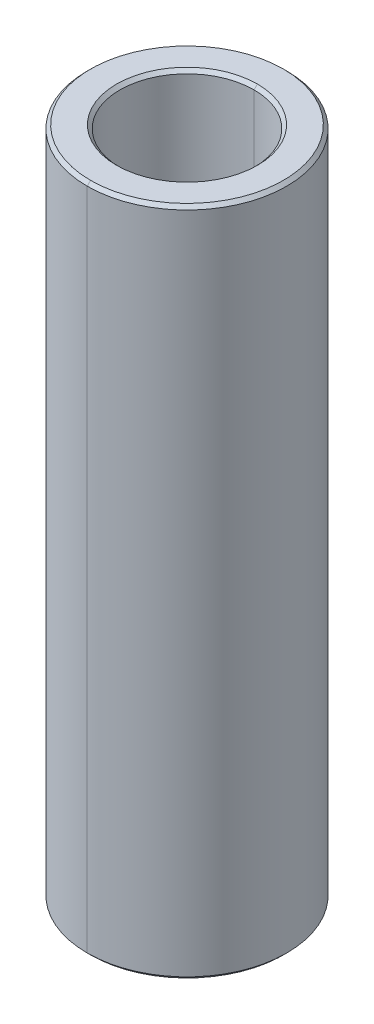
ISO-10303-21;
HEADER;
FILE_DESCRIPTION(('STEP AP214'),'2;1');
FILE_NAME('part.step','',(''),(''),'','','');
FILE_SCHEMA(('AUTOMOTIVE_DESIGN { 1 0 10303 214 1 1 1 1 }'));
ENDSEC;
DATA;
#1=APPLICATION_CONTEXT('core data for automotive mechanical design processes');
#2=APPLICATION_PROTOCOL_DEFINITION('international standard','automotive_design',2000,#1);
#3=PRODUCT_CONTEXT('',#1,'mechanical');
#4=PRODUCT('Part','Part','',(#3));
#5=PRODUCT_RELATED_PRODUCT_CATEGORY('part','',(#4));
#6=PRODUCT_DEFINITION_FORMATION('','',#4);
#7=PRODUCT_DEFINITION_CONTEXT('part definition',#1,'design');
#8=PRODUCT_DEFINITION('design','',#6,#7);
#9=PRODUCT_DEFINITION_SHAPE('','',#8);
#10=(LENGTH_UNIT() NAMED_UNIT(*) SI_UNIT(.MILLI.,.METRE.));
#11=(NAMED_UNIT(*) PLANE_ANGLE_UNIT() SI_UNIT($,.RADIAN.));
#12=(NAMED_UNIT(*) SI_UNIT($,.STERADIAN.) SOLID_ANGLE_UNIT());
#13=UNCERTAINTY_MEASURE_WITH_UNIT(LENGTH_MEASURE(1.E-05),#10,'distance_accuracy_value','');
#14=(GEOMETRIC_REPRESENTATION_CONTEXT(3) GLOBAL_UNCERTAINTY_ASSIGNED_CONTEXT((#13)) GLOBAL_UNIT_ASSIGNED_CONTEXT((#10,
#11,#12)) REPRESENTATION_CONTEXT('',''));
#15=CARTESIAN_POINT('',(0.,0.,0.));
#16=DIRECTION('',(0.,0.,1.));
#17=DIRECTION('',(1.,0.,0.));
#18=AXIS2_PLACEMENT_3D('',#15,#16,#17);
#19=CARTESIAN_POINT('',(0.,9.9,0.));
#20=DIRECTION('',(0.,1.,0.));
#21=DIRECTION('',(0.,0.,1.));
#22=AXIS2_PLACEMENT_3D('',#19,#20,#21);
#23=CONICAL_SURFACE('',#22,2.,0.785398163397448);
#24=DIRECTION('',(0.,0.707106781186548,-0.707106781186548));
#25=VECTOR('',#24,1.);
#26=CARTESIAN_POINT('',(0.,9.9,-2.));
#27=LINE('',#26,#25);
#28=CARTESIAN_POINT('',(0.,9.9,-2.));
#29=VERTEX_POINT('',#28);
#30=CARTESIAN_POINT('',(0.,10.,-2.1));
#31=VERTEX_POINT('',#30);
#32=EDGE_CURVE('E206',#29,#31,#27,.T.);
#33=ORIENTED_EDGE('',*,*,#32,.F.);
#34=CARTESIAN_POINT('',(0.,9.9,0.));
#35=DIRECTION('',(0.,1.,0.));
#36=DIRECTION('',(0.,0.,1.));
#37=AXIS2_PLACEMENT_3D('',#34,#35,#36);
#38=CIRCLE('',#37,2.);
#39=CARTESIAN_POINT('',(0.,9.9,2.));
#40=VERTEX_POINT('',#39);
#41=EDGE_CURVE('E27',#40,#29,#38,.T.);
#42=ORIENTED_EDGE('',*,*,#41,.F.);
#43=DIRECTION('',(0.,0.707106781186548,0.707106781186548));
#44=VECTOR('',#43,1.);
#45=CARTESIAN_POINT('',(0.,9.9,2.));
#46=LINE('',#45,#44);
#47=CARTESIAN_POINT('',(0.,10.,2.1));
#48=VERTEX_POINT('',#47);
#49=EDGE_CURVE('E146',#40,#48,#46,.T.);
#50=ORIENTED_EDGE('',*,*,#49,.T.);
#51=CARTESIAN_POINT('',(0.,10.,0.));
#52=DIRECTION('',(0.,-1.,0.));
#53=DIRECTION('',(0.,0.,1.));
#54=AXIS2_PLACEMENT_3D('',#51,#52,#53);
#55=CIRCLE('',#54,2.1);
#56=EDGE_CURVE('E121',#31,#48,#55,.T.);
#57=ORIENTED_EDGE('',*,*,#56,.F.);
#58=EDGE_LOOP('',(#33,#42,#50,#57));
#59=FACE_BOUND('',#58,.T.);
#60=ADVANCED_FACE('F16',(#59),#23,.F.);
#61=CARTESIAN_POINT('',(0.,-10.,0.));
#62=DIRECTION('',(0.,-1.,0.));
#63=DIRECTION('',(0.,0.,-1.));
#64=AXIS2_PLACEMENT_3D('',#61,#62,#63);
#65=CONICAL_SURFACE('',#64,2.1,0.785398163397448);
#66=DIRECTION('',(0.,-0.707106781186548,0.707106781186548));
#67=VECTOR('',#66,1.);
#68=CARTESIAN_POINT('',(0.,-10.,2.1));
#69=LINE('',#68,#67);
#70=CARTESIAN_POINT('',(0.,-9.9,2.));
#71=VERTEX_POINT('',#70);
#72=CARTESIAN_POINT('',(0.,-10.,2.1));
#73=VERTEX_POINT('',#72);
#74=EDGE_CURVE('E130',#71,#73,#69,.T.);
#75=ORIENTED_EDGE('',*,*,#74,.F.);
#76=CARTESIAN_POINT('',(0.,-9.9,0.));
#77=DIRECTION('',(0.,-1.,0.));
#78=DIRECTION('',(0.,0.,1.));
#79=AXIS2_PLACEMENT_3D('',#76,#77,#78);
#80=CIRCLE('',#79,2.);
#81=CARTESIAN_POINT('',(0.,-9.9,-2.));
#82=VERTEX_POINT('',#81);
#83=EDGE_CURVE('E10',#82,#71,#80,.T.);
#84=ORIENTED_EDGE('',*,*,#83,.F.);
#85=DIRECTION('',(0.,-0.707106781186548,-0.707106781186548));
#86=VECTOR('',#85,1.);
#87=CARTESIAN_POINT('',(0.,-10.,-2.1));
#88=LINE('',#87,#86);
#89=CARTESIAN_POINT('',(0.,-10.,-2.1));
#90=VERTEX_POINT('',#89);
#91=EDGE_CURVE('E138',#82,#90,#88,.T.);
#92=ORIENTED_EDGE('',*,*,#91,.T.);
#93=CARTESIAN_POINT('',(0.,-10.,0.));
#94=DIRECTION('',(0.,1.,0.));
#95=DIRECTION('',(0.,0.,1.));
#96=AXIS2_PLACEMENT_3D('',#93,#94,#95);
#97=CIRCLE('',#96,2.1);
#98=EDGE_CURVE('E79',#73,#90,#97,.T.);
#99=ORIENTED_EDGE('',*,*,#98,.F.);
#100=EDGE_LOOP('',(#75,#84,#92,#99));
#101=FACE_BOUND('',#100,.T.);
#102=ADVANCED_FACE('F261',(#101),#65,.F.);
#103=CARTESIAN_POINT('',(0.,10.,0.));
#104=DIRECTION('',(0.,-1.,0.));
#105=DIRECTION('',(0.,0.,-1.));
#106=AXIS2_PLACEMENT_3D('',#103,#104,#105);
#107=CONICAL_SURFACE('',#106,2.875,0.78539816339744);
#108=DIRECTION('',(0.,-0.707106781186554,0.707106781186542));
#109=VECTOR('',#108,1.);
#110=CARTESIAN_POINT('',(0.,10.,2.875));
#111=LINE('',#110,#109);
#112=CARTESIAN_POINT('',(0.,10.,2.875));
#113=VERTEX_POINT('',#112);
#114=CARTESIAN_POINT('',(0.,9.9,2.975));
#115=VERTEX_POINT('',#114);
#116=EDGE_CURVE('E104',#113,#115,#111,.T.);
#117=ORIENTED_EDGE('',*,*,#116,.F.);
#118=CARTESIAN_POINT('',(0.,10.,0.));
#119=DIRECTION('',(0.,1.,0.));
#120=DIRECTION('',(0.,0.,1.));
#121=AXIS2_PLACEMENT_3D('',#118,#119,#120);
#122=CIRCLE('',#121,2.875);
#123=CARTESIAN_POINT('',(0.,10.,-2.875));
#124=VERTEX_POINT('',#123);
#125=EDGE_CURVE('E90',#124,#113,#122,.T.);
#126=ORIENTED_EDGE('',*,*,#125,.F.);
#127=DIRECTION('',(0.,-0.707106781186554,-0.707106781186542));
#128=VECTOR('',#127,1.);
#129=CARTESIAN_POINT('',(0.,10.,-2.875));
#130=LINE('',#129,#128);
#131=CARTESIAN_POINT('',(0.,9.9,-2.975));
#132=VERTEX_POINT('',#131);
#133=EDGE_CURVE('E94',#124,#132,#130,.T.);
#134=ORIENTED_EDGE('',*,*,#133,.T.);
#135=CARTESIAN_POINT('',(0.,9.9,0.));
#136=DIRECTION('',(0.,-1.,0.));
#137=DIRECTION('',(0.,0.,1.));
#138=AXIS2_PLACEMENT_3D('',#135,#136,#137);
#139=CIRCLE('',#138,2.975);
#140=EDGE_CURVE('E68',#115,#132,#139,.T.);
#141=ORIENTED_EDGE('',*,*,#140,.F.);
#142=EDGE_LOOP('',(#117,#126,#134,#141));
#143=FACE_BOUND('',#142,.T.);
#144=ADVANCED_FACE('F95',(#143),#107,.T.);
#145=CARTESIAN_POINT('',(0.,-9.9,0.));
#146=DIRECTION('',(0.,1.,0.));
#147=DIRECTION('',(0.,0.,1.));
#148=AXIS2_PLACEMENT_3D('',#145,#146,#147);
#149=CONICAL_SURFACE('',#148,2.975,0.78539816339744);
#150=DIRECTION('',(0.,0.707106781186554,-0.707106781186542));
#151=VECTOR('',#150,1.);
#152=CARTESIAN_POINT('',(0.,-9.9,-2.975));
#153=LINE('',#152,#151);
#154=CARTESIAN_POINT('',(0.,-10.,-2.875));
#155=VERTEX_POINT('',#154);
#156=CARTESIAN_POINT('',(0.,-9.9,-2.975));
#157=VERTEX_POINT('',#156);
#158=EDGE_CURVE('E129',#155,#157,#153,.T.);
#159=ORIENTED_EDGE('',*,*,#158,.F.);
#160=CARTESIAN_POINT('',(0.,-10.,0.));
#161=DIRECTION('',(0.,-1.,0.));
#162=DIRECTION('',(0.,0.,1.));
#163=AXIS2_PLACEMENT_3D('',#160,#161,#162);
#164=CIRCLE('',#163,2.875);
#165=CARTESIAN_POINT('',(0.,-10.,2.875));
#166=VERTEX_POINT('',#165);
#167=EDGE_CURVE('E62',#166,#155,#164,.T.);
#168=ORIENTED_EDGE('',*,*,#167,.F.);
#169=DIRECTION('',(0.,0.707106781186554,0.707106781186542));
#170=VECTOR('',#169,1.);
#171=CARTESIAN_POINT('',(0.,-9.9,2.975));
#172=LINE('',#171,#170);
#173=CARTESIAN_POINT('',(0.,-9.9,2.975));
#174=VERTEX_POINT('',#173);
#175=EDGE_CURVE('E113',#166,#174,#172,.T.);
#176=ORIENTED_EDGE('',*,*,#175,.T.);
#177=CARTESIAN_POINT('',(0.,-9.9,0.));
#178=DIRECTION('',(0.,1.,0.));
#179=DIRECTION('',(0.,0.,1.));
#180=AXIS2_PLACEMENT_3D('',#177,#178,#179);
#181=CIRCLE('',#180,2.975);
#182=EDGE_CURVE('E42',#157,#174,#181,.T.);
#183=ORIENTED_EDGE('',*,*,#182,.F.);
#184=EDGE_LOOP('',(#159,#168,#176,#183));
#185=FACE_BOUND('',#184,.T.);
#186=ADVANCED_FACE('F250',(#185),#149,.T.);
#187=CARTESIAN_POINT('',(0.,10.,0.));
#188=DIRECTION('',(0.,-1.,0.));
#189=DIRECTION('',(0.,0.,-1.));
#190=AXIS2_PLACEMENT_3D('',#187,#188,#189);
#191=CYLINDRICAL_SURFACE('',#190,2.);
#192=DIRECTION('',(0.,-1.,0.));
#193=VECTOR('',#192,1.);
#194=CARTESIAN_POINT('',(0.,10.,2.));
#195=LINE('',#194,#193);
#196=EDGE_CURVE('E117',#40,#71,#195,.T.);
#197=ORIENTED_EDGE('',*,*,#196,.F.);
#198=ORIENTED_EDGE('',*,*,#41,.T.);
#199=DIRECTION('',(0.,-1.,0.));
#200=VECTOR('',#199,1.);
#201=CARTESIAN_POINT('',(0.,10.,-2.));
#202=LINE('',#201,#200);
#203=EDGE_CURVE('E20',#29,#82,#202,.T.);
#204=ORIENTED_EDGE('',*,*,#203,.T.);
#205=ORIENTED_EDGE('',*,*,#83,.T.);
#206=EDGE_LOOP('',(#197,#198,#204,#205));
#207=FACE_BOUND('',#206,.T.);
#208=ADVANCED_FACE('F258',(#207),#191,.F.);
#209=CARTESIAN_POINT('',(0.,10.,0.));
#210=DIRECTION('',(0.,-1.,0.));
#211=DIRECTION('',(0.,0.,-1.));
#212=AXIS2_PLACEMENT_3D('',#209,#210,#211);
#213=CYLINDRICAL_SURFACE('',#212,2.975);
#214=DIRECTION('',(0.,-1.,0.));
#215=VECTOR('',#214,1.);
#216=CARTESIAN_POINT('',(0.,10.,2.975));
#217=LINE('',#216,#215);
#218=EDGE_CURVE('E73',#115,#174,#217,.T.);
#219=ORIENTED_EDGE('',*,*,#218,.F.);
#220=ORIENTED_EDGE('',*,*,#140,.T.);
#221=DIRECTION('',(0.,-1.,0.));
#222=VECTOR('',#221,1.);
#223=CARTESIAN_POINT('',(0.,10.,-2.975));
#224=LINE('',#223,#222);
#225=EDGE_CURVE('E71',#132,#157,#224,.T.);
#226=ORIENTED_EDGE('',*,*,#225,.T.);
#227=ORIENTED_EDGE('',*,*,#182,.T.);
#228=EDGE_LOOP('',(#219,#220,#226,#227));
#229=FACE_BOUND('',#228,.T.);
#230=ADVANCED_FACE('F70',(#229),#213,.T.);
#231=CARTESIAN_POINT('',(0.,-10.,0.));
#232=DIRECTION('',(0.,1.,0.));
#233=DIRECTION('',(1.,0.,0.));
#234=AXIS2_PLACEMENT_3D('',#231,#232,#233);
#235=PLANE('',#234);
#236=CARTESIAN_POINT('',(0.,-10.,0.));
#237=DIRECTION('',(0.,1.,0.));
#238=DIRECTION('',(0.,0.,1.));
#239=AXIS2_PLACEMENT_3D('',#236,#237,#238);
#240=CIRCLE('',#239,2.1);
#241=EDGE_CURVE('E134',#90,#73,#240,.T.);
#242=ORIENTED_EDGE('',*,*,#241,.T.);
#243=ORIENTED_EDGE('',*,*,#98,.T.);
#244=EDGE_LOOP('',(#242,#243));
#245=FACE_BOUND('',#244,.T.);
#246=ORIENTED_EDGE('',*,*,#167,.T.);
#247=CARTESIAN_POINT('',(0.,-10.,0.));
#248=DIRECTION('',(0.,-1.,0.));
#249=DIRECTION('',(0.,0.,1.));
#250=AXIS2_PLACEMENT_3D('',#247,#248,#249);
#251=CIRCLE('',#250,2.875);
#252=EDGE_CURVE('E101',#155,#166,#251,.T.);
#253=ORIENTED_EDGE('',*,*,#252,.T.);
#254=EDGE_LOOP('',(#246,#253));
#255=FACE_BOUND('',#254,.T.);
#256=ADVANCED_FACE('F18',(#245,#255),#235,.F.);
#257=CARTESIAN_POINT('',(0.,10.,0.));
#258=DIRECTION('',(0.,1.,0.));
#259=DIRECTION('',(1.,0.,0.));
#260=AXIS2_PLACEMENT_3D('',#257,#258,#259);
#261=PLANE('',#260);
#262=CARTESIAN_POINT('',(0.,10.,0.));
#263=DIRECTION('',(0.,-1.,0.));
#264=DIRECTION('',(0.,0.,1.));
#265=AXIS2_PLACEMENT_3D('',#262,#263,#264);
#266=CIRCLE('',#265,2.1);
#267=EDGE_CURVE('E211',#48,#31,#266,.T.);
#268=ORIENTED_EDGE('',*,*,#267,.T.);
#269=ORIENTED_EDGE('',*,*,#56,.T.);
#270=EDGE_LOOP('',(#268,#269));
#271=FACE_BOUND('',#270,.T.);
#272=ORIENTED_EDGE('',*,*,#125,.T.);
#273=CARTESIAN_POINT('',(0.,10.,0.));
#274=DIRECTION('',(0.,1.,0.));
#275=DIRECTION('',(0.,0.,1.));
#276=AXIS2_PLACEMENT_3D('',#273,#274,#275);
#277=CIRCLE('',#276,2.875);
#278=EDGE_CURVE('E110',#113,#124,#277,.T.);
#279=ORIENTED_EDGE('',*,*,#278,.T.);
#280=EDGE_LOOP('',(#272,#279));
#281=FACE_BOUND('',#280,.T.);
#282=ADVANCED_FACE('F155',(#271,#281),#261,.T.);
#283=CARTESIAN_POINT('',(0.,10.,0.));
#284=DIRECTION('',(0.,-1.,0.));
#285=DIRECTION('',(0.,0.,-1.));
#286=AXIS2_PLACEMENT_3D('',#283,#284,#285);
#287=CYLINDRICAL_SURFACE('',#286,2.975);
#288=CARTESIAN_POINT('',(0.,9.9,0.));
#289=DIRECTION('',(0.,-1.,0.));
#290=DIRECTION('',(0.,0.,1.));
#291=AXIS2_PLACEMENT_3D('',#288,#289,#290);
#292=CIRCLE('',#291,2.975);
#293=EDGE_CURVE('E84',#132,#115,#292,.T.);
#294=ORIENTED_EDGE('',*,*,#293,.T.);
#295=ORIENTED_EDGE('',*,*,#218,.T.);
#296=CARTESIAN_POINT('',(0.,-9.9,0.));
#297=DIRECTION('',(0.,1.,0.));
#298=DIRECTION('',(0.,0.,1.));
#299=AXIS2_PLACEMENT_3D('',#296,#297,#298);
#300=CIRCLE('',#299,2.975);
#301=EDGE_CURVE('E87',#174,#157,#300,.T.);
#302=ORIENTED_EDGE('',*,*,#301,.T.);
#303=ORIENTED_EDGE('',*,*,#225,.F.);
#304=EDGE_LOOP('',(#294,#295,#302,#303));
#305=FACE_BOUND('',#304,.T.);
#306=ADVANCED_FACE('F82',(#305),#287,.T.);
#307=CARTESIAN_POINT('',(0.,10.,0.));
#308=DIRECTION('',(0.,-1.,0.));
#309=DIRECTION('',(0.,0.,-1.));
#310=AXIS2_PLACEMENT_3D('',#307,#308,#309);
#311=CYLINDRICAL_SURFACE('',#310,2.);
#312=CARTESIAN_POINT('',(0.,9.9,0.));
#313=DIRECTION('',(0.,1.,0.));
#314=DIRECTION('',(0.,0.,1.));
#315=AXIS2_PLACEMENT_3D('',#312,#313,#314);
#316=CIRCLE('',#315,2.);
#317=EDGE_CURVE('E217',#29,#40,#316,.T.);
#318=ORIENTED_EDGE('',*,*,#317,.T.);
#319=ORIENTED_EDGE('',*,*,#196,.T.);
#320=CARTESIAN_POINT('',(0.,-9.9,0.));
#321=DIRECTION('',(0.,-1.,0.));
#322=DIRECTION('',(0.,0.,1.));
#323=AXIS2_PLACEMENT_3D('',#320,#321,#322);
#324=CIRCLE('',#323,2.);
#325=EDGE_CURVE('E135',#71,#82,#324,.T.);
#326=ORIENTED_EDGE('',*,*,#325,.T.);
#327=ORIENTED_EDGE('',*,*,#203,.F.);
#328=EDGE_LOOP('',(#318,#319,#326,#327));
#329=FACE_BOUND('',#328,.T.);
#330=ADVANCED_FACE('F271',(#329),#311,.F.);
#331=CARTESIAN_POINT('',(0.,-9.9,0.));
#332=DIRECTION('',(0.,1.,0.));
#333=DIRECTION('',(0.,0.,1.));
#334=AXIS2_PLACEMENT_3D('',#331,#332,#333);
#335=CONICAL_SURFACE('',#334,2.975,0.78539816339744);
#336=ORIENTED_EDGE('',*,*,#252,.F.);
#337=ORIENTED_EDGE('',*,*,#158,.T.);
#338=ORIENTED_EDGE('',*,*,#301,.F.);
#339=ORIENTED_EDGE('',*,*,#175,.F.);
#340=EDGE_LOOP('',(#336,#337,#338,#339));
#341=FACE_BOUND('',#340,.T.);
#342=ADVANCED_FACE('F247',(#341),#335,.T.);
#343=CARTESIAN_POINT('',(0.,10.,0.));
#344=DIRECTION('',(0.,-1.,0.));
#345=DIRECTION('',(0.,0.,-1.));
#346=AXIS2_PLACEMENT_3D('',#343,#344,#345);
#347=CONICAL_SURFACE('',#346,2.875,0.78539816339744);
#348=ORIENTED_EDGE('',*,*,#278,.F.);
#349=ORIENTED_EDGE('',*,*,#116,.T.);
#350=ORIENTED_EDGE('',*,*,#293,.F.);
#351=ORIENTED_EDGE('',*,*,#133,.F.);
#352=EDGE_LOOP('',(#348,#349,#350,#351));
#353=FACE_BOUND('',#352,.T.);
#354=ADVANCED_FACE('F103',(#353),#347,.T.);
#355=CARTESIAN_POINT('',(0.,-10.,0.));
#356=DIRECTION('',(0.,-1.,0.));
#357=DIRECTION('',(0.,0.,-1.));
#358=AXIS2_PLACEMENT_3D('',#355,#356,#357);
#359=CONICAL_SURFACE('',#358,2.1,0.785398163397448);
#360=ORIENTED_EDGE('',*,*,#325,.F.);
#361=ORIENTED_EDGE('',*,*,#74,.T.);
#362=ORIENTED_EDGE('',*,*,#241,.F.);
#363=ORIENTED_EDGE('',*,*,#91,.F.);
#364=EDGE_LOOP('',(#360,#361,#362,#363));
#365=FACE_BOUND('',#364,.T.);
#366=ADVANCED_FACE('F269',(#365),#359,.F.);
#367=CARTESIAN_POINT('',(0.,9.9,0.));
#368=DIRECTION('',(0.,1.,0.));
#369=DIRECTION('',(0.,0.,1.));
#370=AXIS2_PLACEMENT_3D('',#367,#368,#369);
#371=CONICAL_SURFACE('',#370,2.,0.785398163397448);
#372=ORIENTED_EDGE('',*,*,#317,.F.);
#373=ORIENTED_EDGE('',*,*,#32,.T.);
#374=ORIENTED_EDGE('',*,*,#267,.F.);
#375=ORIENTED_EDGE('',*,*,#49,.F.);
#376=EDGE_LOOP('',(#372,#373,#374,#375));
#377=FACE_BOUND('',#376,.T.);
#378=ADVANCED_FACE('F215',(#377),#371,.F.);
#379=CLOSED_SHELL('',(#60,#102,#144,#186,#208,#230,#256,#282,#306,#330,#342,#354,#366,#378));
#380=MANIFOLD_SOLID_BREP('B1',#379);
#381=ADVANCED_BREP_SHAPE_REPRESENTATION('',(#18,#380),#14);
#382=SHAPE_DEFINITION_REPRESENTATION(#9,#381);
ENDSEC;
END-ISO-10303-21;
